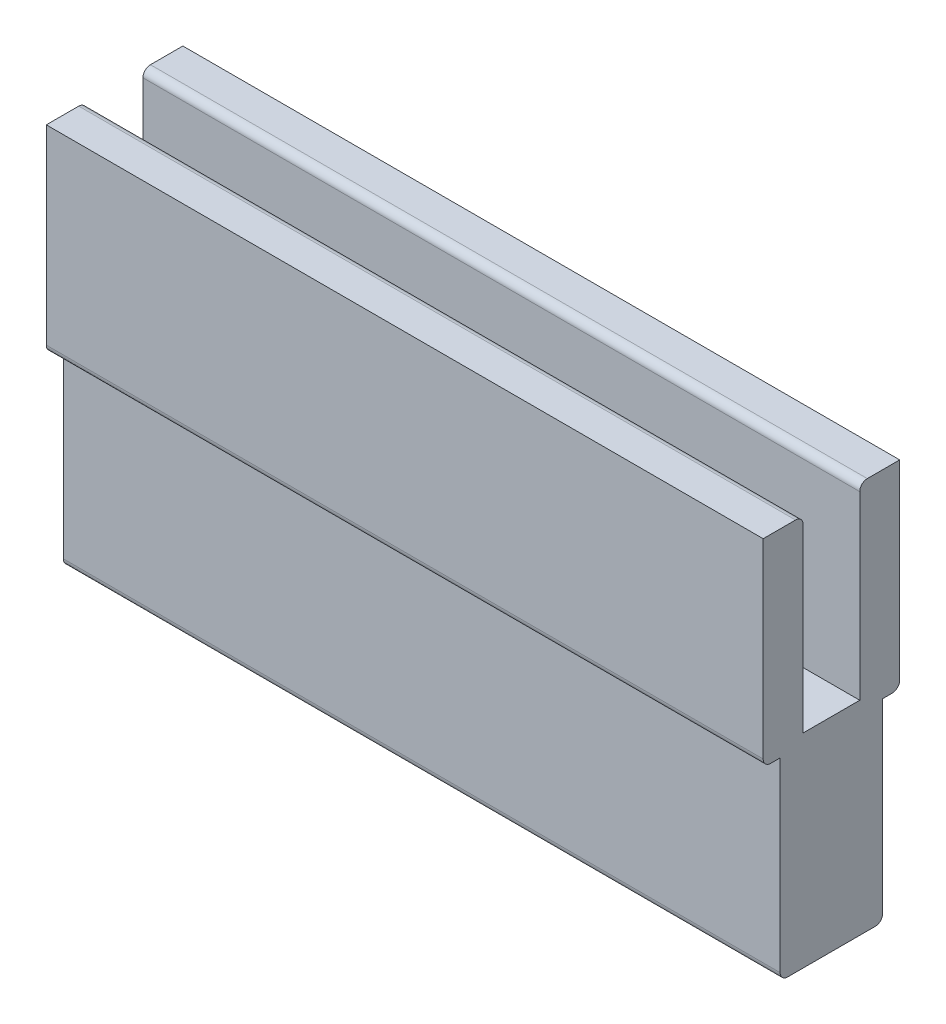
ISO-10303-21;
HEADER;
FILE_DESCRIPTION(('STEP AP214'),'2;1');
FILE_NAME('part.step','',(''),(''),'','','');
FILE_SCHEMA(('AUTOMOTIVE_DESIGN { 1 0 10303 214 1 1 1 1 }'));
ENDSEC;
DATA;
#1=APPLICATION_CONTEXT('core data for automotive mechanical design processes');
#2=APPLICATION_PROTOCOL_DEFINITION('international standard','automotive_design',2000,#1);
#3=PRODUCT_CONTEXT('',#1,'mechanical');
#4=PRODUCT('Part','Part','',(#3));
#5=PRODUCT_RELATED_PRODUCT_CATEGORY('part','',(#4));
#6=PRODUCT_DEFINITION_FORMATION('','',#4);
#7=PRODUCT_DEFINITION_CONTEXT('part definition',#1,'design');
#8=PRODUCT_DEFINITION('design','',#6,#7);
#9=PRODUCT_DEFINITION_SHAPE('','',#8);
#10=(LENGTH_UNIT() NAMED_UNIT(*) SI_UNIT(.MILLI.,.METRE.));
#11=(NAMED_UNIT(*) PLANE_ANGLE_UNIT() SI_UNIT($,.RADIAN.));
#12=(NAMED_UNIT(*) SI_UNIT($,.STERADIAN.) SOLID_ANGLE_UNIT());
#13=UNCERTAINTY_MEASURE_WITH_UNIT(LENGTH_MEASURE(1.E-05),#10,'distance_accuracy_value','');
#14=(GEOMETRIC_REPRESENTATION_CONTEXT(3) GLOBAL_UNCERTAINTY_ASSIGNED_CONTEXT((#13)) GLOBAL_UNIT_ASSIGNED_CONTEXT((#10,
#11,#12)) REPRESENTATION_CONTEXT('',''));
#15=CARTESIAN_POINT('',(0.,0.,0.));
#16=DIRECTION('',(0.,0.,1.));
#17=DIRECTION('',(1.,0.,0.));
#18=AXIS2_PLACEMENT_3D('',#15,#16,#17);
#19=CARTESIAN_POINT('',(-134.704627716474,3.36866350955843E-10,4.77519999809909));
#20=DIRECTION('',(0.,0.,1.));
#21=DIRECTION('',(0.,-1.,0.));
#22=AXIS2_PLACEMENT_3D('',#19,#20,#21);
#23=PLANE('',#22);
#24=DIRECTION('',(0.,-1.,0.));
#25=VECTOR('',#24,1.);
#26=CARTESIAN_POINT('',(-61.595,3.36868905649514E-10,4.77519999809909));
#27=LINE('',#26,#25);
#28=CARTESIAN_POINT('',(-61.595,-1.26999999987985,4.77519999809909));
#29=VERTEX_POINT('',#28);
#30=CARTESIAN_POINT('',(-61.595,-31.7245999996631,4.7751999980991));
#31=VERTEX_POINT('',#30);
#32=EDGE_CURVE('E160',#29,#31,#27,.T.);
#33=ORIENTED_EDGE('',*,*,#32,.F.);
#34=DIRECTION('',(1.,0.,0.));
#35=VECTOR('',#34,1.);
#36=CARTESIAN_POINT('',(-134.704627716474,-1.26999999987985,4.77519999809909));
#37=LINE('',#36,#35);
#38=CARTESIAN_POINT('',(59.2328,-1.26999999987984,4.77519999809909));
#39=VERTEX_POINT('',#38);
#40=EDGE_CURVE('E166',#29,#39,#37,.T.);
#41=ORIENTED_EDGE('',*,*,#40,.T.);
#42=DIRECTION('',(0.,-1.,0.));
#43=VECTOR('',#42,1.);
#44=CARTESIAN_POINT('',(59.2328,3.36873127774912E-10,4.77519999809909));
#45=LINE('',#44,#43);
#46=CARTESIAN_POINT('',(59.2328,-31.7245999996631,4.7751999980991));
#47=VERTEX_POINT('',#46);
#48=EDGE_CURVE('E174',#39,#47,#45,.T.);
#49=ORIENTED_EDGE('',*,*,#48,.T.);
#50=DIRECTION('',(1.,0.,0.));
#51=VECTOR('',#50,1.);
#52=CARTESIAN_POINT('',(-134.704627716474,-31.7245999996631,4.7751999980991));
#53=LINE('',#52,#51);
#54=EDGE_CURVE('E210',#31,#47,#53,.T.);
#55=ORIENTED_EDGE('',*,*,#54,.F.);
#56=EDGE_LOOP('',(#33,#41,#49,#55));
#57=FACE_BOUND('',#56,.T.);
#58=ADVANCED_FACE('F18',(#57),#23,.F.);
#59=CARTESIAN_POINT('',(-134.704627716474,-31.7245999996631,4.7751999980991));
#60=DIRECTION('',(0.,-1.,0.));
#61=DIRECTION('',(1.,0.,0.));
#62=AXIS2_PLACEMENT_3D('',#59,#60,#61);
#63=PLANE('',#62);
#64=DIRECTION('',(0.,0.,-1.));
#65=VECTOR('',#64,1.);
#66=CARTESIAN_POINT('',(-61.595,-31.7245999996631,4.7751999980991));
#67=LINE('',#66,#65);
#68=CARTESIAN_POINT('',(-61.595,-31.7245999996631,-4.77519999809909));
#69=VERTEX_POINT('',#68);
#70=EDGE_CURVE('E206',#31,#69,#67,.T.);
#71=ORIENTED_EDGE('',*,*,#70,.F.);
#72=ORIENTED_EDGE('',*,*,#54,.T.);
#73=DIRECTION('',(0.,0.,-1.));
#74=VECTOR('',#73,1.);
#75=CARTESIAN_POINT('',(59.2328,-31.7245999996631,4.7751999980991));
#76=LINE('',#75,#74);
#77=CARTESIAN_POINT('',(59.2328,-31.7245999996631,-4.77519999809909));
#78=VERTEX_POINT('',#77);
#79=EDGE_CURVE('E213',#47,#78,#76,.T.);
#80=ORIENTED_EDGE('',*,*,#79,.T.);
#81=DIRECTION('',(1.,0.,0.));
#82=VECTOR('',#81,1.);
#83=CARTESIAN_POINT('',(-134.704627716474,-31.7245999996631,-4.77519999809909));
#84=LINE('',#83,#82);
#85=EDGE_CURVE('E214',#69,#78,#84,.T.);
#86=ORIENTED_EDGE('',*,*,#85,.F.);
#87=EDGE_LOOP('',(#71,#72,#80,#86));
#88=FACE_BOUND('',#87,.T.);
#89=ADVANCED_FACE('F280',(#88),#63,.F.);
#90=CARTESIAN_POINT('',(-134.704627716474,3.36865181369163E-10,-4.77519999809909));
#91=DIRECTION('',(0.,0.,-1.));
#92=DIRECTION('',(0.,1.,0.));
#93=AXIS2_PLACEMENT_3D('',#90,#91,#92);
#94=PLANE('',#93);
#95=DIRECTION('',(0.,1.,0.));
#96=VECTOR('',#95,1.);
#97=CARTESIAN_POINT('',(59.2328,3.36871958188234E-10,-4.77519999809909));
#98=LINE('',#97,#96);
#99=CARTESIAN_POINT('',(59.2328,-1.26999999957353,-4.77519999809909));
#100=VERTEX_POINT('',#99);
#101=EDGE_CURVE('E216',#78,#100,#98,.T.);
#102=ORIENTED_EDGE('',*,*,#101,.T.);
#103=DIRECTION('',(1.,0.,0.));
#104=VECTOR('',#103,1.);
#105=CARTESIAN_POINT('',(-134.704627716474,-1.26999999957354,-4.77519999809909));
#106=LINE('',#105,#104);
#107=CARTESIAN_POINT('',(-61.595,-1.26999999957354,-4.77519999809909));
#108=VERTEX_POINT('',#107);
#109=EDGE_CURVE('E11',#100,#108,#106,.F.);
#110=ORIENTED_EDGE('',*,*,#109,.T.);
#111=DIRECTION('',(0.,1.,0.));
#112=VECTOR('',#111,1.);
#113=CARTESIAN_POINT('',(-61.595,3.36867736062836E-10,-4.77519999809909));
#114=LINE('',#113,#112);
#115=EDGE_CURVE('E204',#69,#108,#114,.T.);
#116=ORIENTED_EDGE('',*,*,#115,.F.);
#117=ORIENTED_EDGE('',*,*,#85,.T.);
#118=EDGE_LOOP('',(#102,#110,#116,#117));
#119=FACE_BOUND('',#118,.T.);
#120=ADVANCED_FACE('F282',(#119),#94,.F.);
#121=CARTESIAN_POINT('',(-134.704627716474,3.36865181369163E-10,-4.77519999809909));
#122=DIRECTION('',(0.,-1.,-7.05461458278208E-11));
#123=DIRECTION('',(0.,7.05461458278208E-11,-1.));
#124=AXIS2_PLACEMENT_3D('',#121,#122,#123);
#125=PLANE('',#124);
#126=DIRECTION('',(0.,7.05461458278208E-11,-1.));
#127=VECTOR('',#126,1.);
#128=CARTESIAN_POINT('',(-61.595,3.36867736062836E-10,-4.77519999809909));
#129=LINE('',#128,#127);
#130=CARTESIAN_POINT('',(-61.595,4.26461341257847E-10,-6.0451999980095));
#131=VERTEX_POINT('',#130);
#132=CARTESIAN_POINT('',(-61.595,8.11713843535923E-10,-11.506199996767));
#133=VERTEX_POINT('',#132);
#134=EDGE_CURVE('E202',#131,#133,#129,.T.);
#135=ORIENTED_EDGE('',*,*,#134,.F.);
#136=DIRECTION('',(1.,0.,0.));
#137=VECTOR('',#136,1.);
#138=CARTESIAN_POINT('',(-134.704627716474,4.26458786564175E-10,-6.0451999980095));
#139=LINE('',#138,#137);
#140=CARTESIAN_POINT('',(59.2328,4.26465563383245E-10,-6.0451999980095));
#141=VERTEX_POINT('',#140);
#142=EDGE_CURVE('E26',#131,#141,#139,.T.);
#143=ORIENTED_EDGE('',*,*,#142,.T.);
#144=DIRECTION('',(0.,7.05461458278208E-11,-1.));
#145=VECTOR('',#144,1.);
#146=CARTESIAN_POINT('',(59.2328,3.36871958188234E-10,-4.77519999809909));
#147=LINE('',#146,#145);
#148=CARTESIAN_POINT('',(59.2328,8.11718065661321E-10,-11.506199996767));
#149=VERTEX_POINT('',#148);
#150=EDGE_CURVE('E221',#141,#149,#147,.T.);
#151=ORIENTED_EDGE('',*,*,#150,.T.);
#152=DIRECTION('',(1.,0.,0.));
#153=VECTOR('',#152,1.);
#154=CARTESIAN_POINT('',(-134.704627716474,8.11711288842252E-10,-11.506199996767));
#155=LINE('',#154,#153);
#156=EDGE_CURVE('E217',#133,#149,#155,.T.);
#157=ORIENTED_EDGE('',*,*,#156,.F.);
#158=EDGE_LOOP('',(#135,#143,#151,#157));
#159=FACE_BOUND('',#158,.T.);
#160=ADVANCED_FACE('F261',(#159),#125,.F.);
#161=CARTESIAN_POINT('',(-134.704627716474,8.11711288842252E-10,-11.506199996767));
#162=DIRECTION('',(0.,-1.25964248608914E-10,1.));
#163=DIRECTION('',(0.,-1.,-1.25964248608914E-10));
#164=AXIS2_PLACEMENT_3D('',#161,#162,#163);
#165=PLANE('',#164);
#166=DIRECTION('',(0.,-1.,-1.25964248608914E-10));
#167=VECTOR('',#166,1.);
#168=CARTESIAN_POINT('',(-61.595,8.11713843535923E-10,-11.506199996767));
#169=LINE('',#168,#167);
#170=CARTESIAN_POINT('',(-61.595,-32.1564000073889,-11.5062000008176));
#171=VERTEX_POINT('',#170);
#172=EDGE_CURVE('E199',#133,#171,#169,.T.);
#173=ORIENTED_EDGE('',*,*,#172,.F.);
#174=ORIENTED_EDGE('',*,*,#156,.T.);
#175=DIRECTION('',(0.,-1.,-1.25964248608914E-10));
#176=VECTOR('',#175,1.);
#177=CARTESIAN_POINT('',(59.2328,8.11718065661321E-10,-11.506199996767));
#178=LINE('',#177,#176);
#179=CARTESIAN_POINT('',(59.2328,-32.1564000073889,-11.5062000008176));
#180=VERTEX_POINT('',#179);
#181=EDGE_CURVE('E220',#149,#180,#178,.T.);
#182=ORIENTED_EDGE('',*,*,#181,.T.);
#183=DIRECTION('',(1.,0.,0.));
#184=VECTOR('',#183,1.);
#185=CARTESIAN_POINT('',(-134.704627716474,-32.1564000073889,-11.5062000008176));
#186=LINE('',#185,#184);
#187=EDGE_CURVE('E222',#171,#180,#186,.T.);
#188=ORIENTED_EDGE('',*,*,#187,.F.);
#189=EDGE_LOOP('',(#173,#174,#182,#188));
#190=FACE_BOUND('',#189,.T.);
#191=ADVANCED_FACE('F351',(#190),#165,.F.);
#192=CARTESIAN_POINT('',(-134.704627716474,-32.1564000075489,-10.2362000008176));
#193=DIRECTION('',(1.,0.,0.));
#194=DIRECTION('',(0.,1.,0.));
#195=AXIS2_PLACEMENT_3D('',#192,#193,#194);
#196=CYLINDRICAL_SURFACE('',#195,1.27);
#197=CARTESIAN_POINT('',(-61.595,-32.1564000075489,-10.2362000008176));
#198=DIRECTION('',(-1.,0.,0.));
#199=DIRECTION('',(0.,-1.,0.));
#200=AXIS2_PLACEMENT_3D('',#197,#198,#199);
#201=CIRCLE('',#200,1.27);
#202=CARTESIAN_POINT('',(-61.595,-33.4264000075488,-10.2362000002068));
#203=VERTEX_POINT('',#202);
#204=EDGE_CURVE('E196',#171,#203,#201,.T.);
#205=ORIENTED_EDGE('',*,*,#204,.F.);
#206=ORIENTED_EDGE('',*,*,#187,.T.);
#207=CARTESIAN_POINT('',(59.2328,-32.1564000075489,-10.2362000008176));
#208=DIRECTION('',(-1.,0.,0.));
#209=DIRECTION('',(0.,1.,0.));
#210=AXIS2_PLACEMENT_3D('',#207,#208,#209);
#211=CIRCLE('',#210,1.27);
#212=CARTESIAN_POINT('',(59.2328,-33.4264000075488,-10.2362000002068));
#213=VERTEX_POINT('',#212);
#214=EDGE_CURVE('E224',#180,#213,#211,.T.);
#215=ORIENTED_EDGE('',*,*,#214,.T.);
#216=DIRECTION('',(1.,0.,0.));
#217=VECTOR('',#216,1.);
#218=CARTESIAN_POINT('',(-134.704627716474,-33.4264000075488,-10.2362000002068));
#219=LINE('',#218,#217);
#220=EDGE_CURVE('E225',#203,#213,#219,.T.);
#221=ORIENTED_EDGE('',*,*,#220,.F.);
#222=EDGE_LOOP('',(#205,#206,#215,#221));
#223=FACE_BOUND('',#222,.T.);
#224=ADVANCED_FACE('F347',(#223),#196,.T.);
#225=CARTESIAN_POINT('',(-134.704627716474,-33.4264000067854,-8.64869999904722));
#226=DIRECTION('',(0.,1.,-4.80901407583008E-10));
#227=DIRECTION('',(0.,4.80901407583008E-10,1.));
#228=AXIS2_PLACEMENT_3D('',#225,#226,#227);
#229=PLANE('',#228);
#230=DIRECTION('',(0.,4.80901407583008E-10,1.));
#231=VECTOR('',#230,1.);
#232=CARTESIAN_POINT('',(-61.595,-33.4264000067854,-8.64869999904722));
#233=LINE('',#232,#231);
#234=CARTESIAN_POINT('',(-61.595,-33.4264000067854,-8.64869999904722));
#235=VERTEX_POINT('',#234);
#236=EDGE_CURVE('E193',#203,#235,#233,.T.);
#237=ORIENTED_EDGE('',*,*,#236,.F.);
#238=ORIENTED_EDGE('',*,*,#220,.T.);
#239=DIRECTION('',(0.,4.80901407583008E-10,1.));
#240=VECTOR('',#239,1.);
#241=CARTESIAN_POINT('',(59.2328,-33.4264000067854,-8.64869999904722));
#242=LINE('',#241,#240);
#243=CARTESIAN_POINT('',(59.2328,-33.4264000067854,-8.64869999904722));
#244=VERTEX_POINT('',#243);
#245=EDGE_CURVE('E227',#213,#244,#242,.T.);
#246=ORIENTED_EDGE('',*,*,#245,.T.);
#247=DIRECTION('',(1.,0.,0.));
#248=VECTOR('',#247,1.);
#249=CARTESIAN_POINT('',(-134.704627716474,-33.4264000067854,-8.64869999904722));
#250=LINE('',#249,#248);
#251=EDGE_CURVE('E228',#235,#244,#250,.T.);
#252=ORIENTED_EDGE('',*,*,#251,.F.);
#253=EDGE_LOOP('',(#237,#238,#246,#252));
#254=FACE_BOUND('',#253,.T.);
#255=ADVANCED_FACE('F343',(#254),#229,.F.);
#256=CARTESIAN_POINT('',(-134.704627716474,-33.4264000067854,-8.64869999904722));
#257=DIRECTION('',(0.,-1.28813163686896E-10,1.));
#258=DIRECTION('',(0.,-1.,-1.28813163686896E-10));
#259=AXIS2_PLACEMENT_3D('',#256,#257,#258);
#260=PLANE('',#259);
#261=DIRECTION('',(0.,-1.,-1.28813163686896E-10));
#262=VECTOR('',#261,1.);
#263=CARTESIAN_POINT('',(-61.595,-33.4264000067854,-8.64869999904722));
#264=LINE('',#263,#262);
#265=CARTESIAN_POINT('',(-61.595,-64.7699999993159,-8.64870000308469));
#266=VERTEX_POINT('',#265);
#267=EDGE_CURVE('E190',#235,#266,#264,.T.);
#268=ORIENTED_EDGE('',*,*,#267,.F.);
#269=ORIENTED_EDGE('',*,*,#251,.T.);
#270=DIRECTION('',(0.,-1.,-1.28813163686896E-10));
#271=VECTOR('',#270,1.);
#272=CARTESIAN_POINT('',(59.2328,-33.4264000067854,-8.64869999904722));
#273=LINE('',#272,#271);
#274=CARTESIAN_POINT('',(59.2328,-64.7699999993159,-8.64870000308469));
#275=VERTEX_POINT('',#274);
#276=EDGE_CURVE('E230',#244,#275,#273,.T.);
#277=ORIENTED_EDGE('',*,*,#276,.T.);
#278=DIRECTION('',(1.,0.,0.));
#279=VECTOR('',#278,1.);
#280=CARTESIAN_POINT('',(-134.704627716474,-64.7699999993159,-8.64870000308469));
#281=LINE('',#280,#279);
#282=EDGE_CURVE('E231',#266,#275,#281,.T.);
#283=ORIENTED_EDGE('',*,*,#282,.F.);
#284=EDGE_LOOP('',(#268,#269,#277,#283));
#285=FACE_BOUND('',#284,.T.);
#286=ADVANCED_FACE('F339',(#285),#260,.F.);
#287=CARTESIAN_POINT('',(-134.704627716474,-64.7699999994795,-7.37870000308469));
#288=DIRECTION('',(1.,0.,0.));
#289=DIRECTION('',(0.,1.,0.));
#290=AXIS2_PLACEMENT_3D('',#287,#288,#289);
#291=CYLINDRICAL_SURFACE('',#290,1.27);
#292=CARTESIAN_POINT('',(-61.595,-64.7699999994795,-7.37870000308469));
#293=DIRECTION('',(-1.,0.,0.));
#294=DIRECTION('',(0.,-1.,0.));
#295=AXIS2_PLACEMENT_3D('',#292,#293,#294);
#296=CIRCLE('',#295,1.27);
#297=CARTESIAN_POINT('',(-61.595,-66.0399999994795,-7.37870000317428));
#298=VERTEX_POINT('',#297);
#299=EDGE_CURVE('E187',#266,#298,#296,.T.);
#300=ORIENTED_EDGE('',*,*,#299,.F.);
#301=ORIENTED_EDGE('',*,*,#282,.T.);
#302=CARTESIAN_POINT('',(59.2328,-64.7699999994795,-7.37870000308469));
#303=DIRECTION('',(-1.,0.,0.));
#304=DIRECTION('',(0.,-1.,0.));
#305=AXIS2_PLACEMENT_3D('',#302,#303,#304);
#306=CIRCLE('',#305,1.27);
#307=CARTESIAN_POINT('',(59.2328,-66.0399999994795,-7.37870000317428));
#308=VERTEX_POINT('',#307);
#309=EDGE_CURVE('E233',#275,#308,#306,.T.);
#310=ORIENTED_EDGE('',*,*,#309,.T.);
#311=DIRECTION('',(1.,0.,0.));
#312=VECTOR('',#311,1.);
#313=CARTESIAN_POINT('',(-134.704627716474,-66.0399999994795,-7.37870000317428));
#314=LINE('',#313,#312);
#315=EDGE_CURVE('E234',#298,#308,#314,.T.);
#316=ORIENTED_EDGE('',*,*,#315,.F.);
#317=EDGE_LOOP('',(#300,#301,#310,#316));
#318=FACE_BOUND('',#317,.T.);
#319=ADVANCED_FACE('F335',(#318),#291,.T.);
#320=CARTESIAN_POINT('',(-134.704627716474,-66.0399999994795,-7.37870000317428));
#321=DIRECTION('',(0.,1.,7.0543744318534E-11));
#322=DIRECTION('',(0.,-7.0543744318534E-11,1.));
#323=AXIS2_PLACEMENT_3D('',#320,#321,#322);
#324=PLANE('',#323);
#325=DIRECTION('',(0.,-7.0543744318534E-11,1.));
#326=VECTOR('',#325,1.);
#327=CARTESIAN_POINT('',(-61.595,-66.0399999994795,-7.37870000317428));
#328=LINE('',#327,#326);
#329=CARTESIAN_POINT('',(-61.595,-66.0400000005205,7.37869999678133));
#330=VERTEX_POINT('',#329);
#331=EDGE_CURVE('E184',#298,#330,#328,.T.);
#332=ORIENTED_EDGE('',*,*,#331,.F.);
#333=ORIENTED_EDGE('',*,*,#315,.T.);
#334=DIRECTION('',(0.,-7.0543744318534E-11,1.));
#335=VECTOR('',#334,1.);
#336=CARTESIAN_POINT('',(59.2328,-66.0399999994795,-7.37870000317428));
#337=LINE('',#336,#335);
#338=CARTESIAN_POINT('',(59.2328,-66.0400000005205,7.37869999678133));
#339=VERTEX_POINT('',#338);
#340=EDGE_CURVE('E236',#308,#339,#337,.T.);
#341=ORIENTED_EDGE('',*,*,#340,.T.);
#342=DIRECTION('',(1.,0.,0.));
#343=VECTOR('',#342,1.);
#344=CARTESIAN_POINT('',(-134.704627716474,-66.0400000005205,7.37869999678133));
#345=LINE('',#344,#343);
#346=EDGE_CURVE('E237',#330,#339,#345,.T.);
#347=ORIENTED_EDGE('',*,*,#346,.F.);
#348=EDGE_LOOP('',(#332,#333,#341,#347));
#349=FACE_BOUND('',#348,.T.);
#350=ADVANCED_FACE('F331',(#349),#324,.F.);
#351=CARTESIAN_POINT('',(-134.704627716474,-64.7700000005205,7.37869999687092));
#352=DIRECTION('',(1.,0.,0.));
#353=DIRECTION('',(0.,1.,0.));
#354=AXIS2_PLACEMENT_3D('',#351,#352,#353);
#355=CYLINDRICAL_SURFACE('',#354,1.27);
#356=CARTESIAN_POINT('',(-61.595,-64.7700000005205,7.37869999687092));
#357=DIRECTION('',(-1.,0.,0.));
#358=DIRECTION('',(0.,-1.,0.));
#359=AXIS2_PLACEMENT_3D('',#356,#357,#358);
#360=CIRCLE('',#359,1.27);
#361=CARTESIAN_POINT('',(-61.595,-64.7700000005731,8.64869999687092));
#362=VERTEX_POINT('',#361);
#363=EDGE_CURVE('E181',#330,#362,#360,.T.);
#364=ORIENTED_EDGE('',*,*,#363,.F.);
#365=ORIENTED_EDGE('',*,*,#346,.T.);
#366=CARTESIAN_POINT('',(59.2328,-64.7700000005205,7.37869999687092));
#367=DIRECTION('',(-1.,0.,0.));
#368=DIRECTION('',(0.,-1.,0.));
#369=AXIS2_PLACEMENT_3D('',#366,#367,#368);
#370=CIRCLE('',#369,1.27);
#371=CARTESIAN_POINT('',(59.2328,-64.7700000005731,8.64869999687092));
#372=VERTEX_POINT('',#371);
#373=EDGE_CURVE('E239',#339,#372,#370,.T.);
#374=ORIENTED_EDGE('',*,*,#373,.T.);
#375=DIRECTION('',(1.,0.,0.));
#376=VECTOR('',#375,1.);
#377=CARTESIAN_POINT('',(-134.704627716474,-64.7700000005731,8.64869999687092));
#378=LINE('',#377,#376);
#379=EDGE_CURVE('E240',#362,#372,#378,.T.);
#380=ORIENTED_EDGE('',*,*,#379,.F.);
#381=EDGE_LOOP('',(#364,#365,#374,#380));
#382=FACE_BOUND('',#381,.T.);
#383=ADVANCED_FACE('F327',(#382),#355,.T.);
#384=CARTESIAN_POINT('',(-134.704627716474,-33.4263999984671,8.64869999816894));
#385=DIRECTION('',(0.,4.14126792494708E-11,-1.));
#386=DIRECTION('',(0.,1.,4.14126792494708E-11));
#387=AXIS2_PLACEMENT_3D('',#384,#385,#386);
#388=PLANE('',#387);
#389=DIRECTION('',(0.,1.,4.14126792494708E-11));
#390=VECTOR('',#389,1.);
#391=CARTESIAN_POINT('',(-61.595,-33.4263999984671,8.64869999816894));
#392=LINE('',#391,#390);
#393=CARTESIAN_POINT('',(-61.595,-33.4263999984671,8.64869999816894));
#394=VERTEX_POINT('',#393);
#395=EDGE_CURVE('E178',#362,#394,#392,.T.);
#396=ORIENTED_EDGE('',*,*,#395,.F.);
#397=ORIENTED_EDGE('',*,*,#379,.T.);
#398=DIRECTION('',(0.,1.,4.14126792494708E-11));
#399=VECTOR('',#398,1.);
#400=CARTESIAN_POINT('',(59.2328,-33.4263999984671,8.64869999816894));
#401=LINE('',#400,#399);
#402=CARTESIAN_POINT('',(59.2328,-33.4263999984671,8.64869999816894));
#403=VERTEX_POINT('',#402);
#404=EDGE_CURVE('E242',#372,#403,#401,.T.);
#405=ORIENTED_EDGE('',*,*,#404,.T.);
#406=DIRECTION('',(1.,0.,0.));
#407=VECTOR('',#406,1.);
#408=CARTESIAN_POINT('',(-134.704627716474,-33.4263999984671,8.64869999816894));
#409=LINE('',#408,#407);
#410=EDGE_CURVE('E243',#394,#403,#409,.T.);
#411=ORIENTED_EDGE('',*,*,#410,.F.);
#412=EDGE_LOOP('',(#396,#397,#405,#411));
#413=FACE_BOUND('',#412,.T.);
#414=ADVANCED_FACE('F323',(#413),#388,.F.);
#415=CARTESIAN_POINT('',(-134.704627716474,-33.4263999977037,10.236199203684));
#416=DIRECTION('',(0.,1.,-4.80901648607743E-10));
#417=DIRECTION('',(0.,4.80901648607743E-10,1.));
#418=AXIS2_PLACEMENT_3D('',#415,#416,#417);
#419=PLANE('',#418);
#420=DIRECTION('',(0.,4.80901648607743E-10,1.));
#421=VECTOR('',#420,1.);
#422=CARTESIAN_POINT('',(-61.595,-33.4263999977037,10.236199203684));
#423=LINE('',#422,#421);
#424=CARTESIAN_POINT('',(-61.595,-33.4263999977037,10.236199203684));
#425=VERTEX_POINT('',#424);
#426=EDGE_CURVE('E171',#394,#425,#423,.T.);
#427=ORIENTED_EDGE('',*,*,#426,.F.);
#428=ORIENTED_EDGE('',*,*,#410,.T.);
#429=DIRECTION('',(0.,4.80901648607743E-10,1.));
#430=VECTOR('',#429,1.);
#431=CARTESIAN_POINT('',(59.2328,-33.4263999977037,10.236199203684));
#432=LINE('',#431,#430);
#433=CARTESIAN_POINT('',(59.2328,-33.4263999977037,10.236199203684));
#434=VERTEX_POINT('',#433);
#435=EDGE_CURVE('E245',#403,#434,#432,.T.);
#436=ORIENTED_EDGE('',*,*,#435,.T.);
#437=DIRECTION('',(1.,0.,0.));
#438=VECTOR('',#437,1.);
#439=CARTESIAN_POINT('',(-134.704627716474,-33.4263999977037,10.236199203684));
#440=LINE('',#439,#438);
#441=EDGE_CURVE('E246',#425,#434,#440,.T.);
#442=ORIENTED_EDGE('',*,*,#441,.F.);
#443=EDGE_LOOP('',(#427,#428,#436,#442));
#444=FACE_BOUND('',#443,.T.);
#445=ADVANCED_FACE('F319',(#444),#419,.F.);
#446=CARTESIAN_POINT('',(-134.704627716474,-32.1563999977037,10.2361992030733));
#447=DIRECTION('',(1.,0.,0.));
#448=DIRECTION('',(0.,1.,0.));
#449=AXIS2_PLACEMENT_3D('',#446,#447,#448);
#450=CYLINDRICAL_SURFACE('',#449,1.27);
#451=CARTESIAN_POINT('',(-61.595,-32.1563999977037,10.2361992030733));
#452=DIRECTION('',(-1.,0.,0.));
#453=DIRECTION('',(0.,-1.,0.));
#454=AXIS2_PLACEMENT_3D('',#451,#452,#453);
#455=CIRCLE('',#454,1.27);
#456=CARTESIAN_POINT('',(-61.595,-32.1564000290648,11.5061992030733));
#457=VERTEX_POINT('',#456);
#458=EDGE_CURVE('E165',#425,#457,#455,.T.);
#459=ORIENTED_EDGE('',*,*,#458,.F.);
#460=ORIENTED_EDGE('',*,*,#441,.T.);
#461=CARTESIAN_POINT('',(59.2328,-32.1563999977037,10.2361992030733));
#462=DIRECTION('',(-1.,0.,0.));
#463=DIRECTION('',(0.,-1.,0.));
#464=AXIS2_PLACEMENT_3D('',#461,#462,#463);
#465=CIRCLE('',#464,1.27);
#466=CARTESIAN_POINT('',(59.2328,-32.1564000290648,11.5061992030733));
#467=VERTEX_POINT('',#466);
#468=EDGE_CURVE('E248',#434,#467,#465,.T.);
#469=ORIENTED_EDGE('',*,*,#468,.T.);
#470=DIRECTION('',(1.,0.,0.));
#471=VECTOR('',#470,1.);
#472=CARTESIAN_POINT('',(-134.704627716474,-32.1564000290648,11.5061992030733));
#473=LINE('',#472,#471);
#474=EDGE_CURVE('E249',#457,#467,#473,.T.);
#475=ORIENTED_EDGE('',*,*,#474,.F.);
#476=EDGE_LOOP('',(#459,#460,#469,#475));
#477=FACE_BOUND('',#476,.T.);
#478=ADVANCED_FACE('F316',(#477),#450,.T.);
#479=CARTESIAN_POINT('',(-134.704627716474,-32.1564000290648,11.5061992030733));
#480=DIRECTION('',(0.,2.46938004191586E-08,-1.));
#481=DIRECTION('',(0.,1.,2.46938004191586E-08));
#482=AXIS2_PLACEMENT_3D('',#479,#480,#481);
#483=PLANE('',#482);
#484=DIRECTION('',(0.,1.,2.46938004191586E-08));
#485=VECTOR('',#484,1.);
#486=CARTESIAN_POINT('',(-61.595,-32.1564000290648,11.5061992030733));
#487=LINE('',#486,#485);
#488=CARTESIAN_POINT('',(-61.595,-8.11722282282169E-10,11.506199997137));
#489=VERTEX_POINT('',#488);
#490=EDGE_CURVE('E145',#457,#489,#487,.T.);
#491=ORIENTED_EDGE('',*,*,#490,.F.);
#492=ORIENTED_EDGE('',*,*,#474,.T.);
#493=DIRECTION('',(0.,1.,2.46938004191586E-08));
#494=VECTOR('',#493,1.);
#495=CARTESIAN_POINT('',(59.2328,-32.1564000290648,11.5061992030733));
#496=LINE('',#495,#494);
#497=CARTESIAN_POINT('',(59.2328,-8.11718060156771E-10,11.506199997137));
#498=VERTEX_POINT('',#497);
#499=EDGE_CURVE('E148',#467,#498,#496,.T.);
#500=ORIENTED_EDGE('',*,*,#499,.T.);
#501=DIRECTION('',(1.,0.,0.));
#502=VECTOR('',#501,1.);
#503=CARTESIAN_POINT('',(-134.704627716474,-8.11724836975841E-10,11.506199997137));
#504=LINE('',#503,#502);
#505=EDGE_CURVE('E141',#489,#498,#504,.T.);
#506=ORIENTED_EDGE('',*,*,#505,.F.);
#507=EDGE_LOOP('',(#491,#492,#500,#506));
#508=FACE_BOUND('',#507,.T.);
#509=ADVANCED_FACE('F143',(#508),#483,.F.);
#510=CARTESIAN_POINT('',(-134.704627716474,-8.11724836975841E-10,11.506199997137));
#511=DIRECTION('',(0.,-1.,-1.70641983077679E-10));
#512=DIRECTION('',(0.,1.70641983077679E-10,-1.));
#513=AXIS2_PLACEMENT_3D('',#510,#511,#512);
#514=PLANE('',#513);
#515=DIRECTION('',(0.,1.70641983077679E-10,-1.));
#516=VECTOR('',#515,1.);
#517=CARTESIAN_POINT('',(59.2328,-8.11718060156771E-10,11.506199997137));
#518=LINE('',#517,#516);
#519=CARTESIAN_POINT('',(59.2328,1.20157809229279E-10,6.04519999831581));
#520=VERTEX_POINT('',#519);
#521=EDGE_CURVE('E152',#498,#520,#518,.T.);
#522=ORIENTED_EDGE('',*,*,#521,.T.);
#523=DIRECTION('',(1.,0.,0.));
#524=VECTOR('',#523,1.);
#525=CARTESIAN_POINT('',(-134.704627716474,1.20151032410209E-10,6.04519999831581));
#526=LINE('',#525,#524);
#527=CARTESIAN_POINT('',(-61.595,1.20153587103881E-10,6.04519999831581));
#528=VERTEX_POINT('',#527);
#529=EDGE_CURVE('E158',#520,#528,#526,.F.);
#530=ORIENTED_EDGE('',*,*,#529,.T.);
#531=DIRECTION('',(0.,1.70641983077679E-10,-1.));
#532=VECTOR('',#531,1.);
#533=CARTESIAN_POINT('',(-61.595,-8.11722282282169E-10,11.506199997137));
#534=LINE('',#533,#532);
#535=EDGE_CURVE('E155',#489,#528,#534,.T.);
#536=ORIENTED_EDGE('',*,*,#535,.F.);
#537=ORIENTED_EDGE('',*,*,#505,.T.);
#538=EDGE_LOOP('',(#522,#530,#536,#537));
#539=FACE_BOUND('',#538,.T.);
#540=ADVANCED_FACE('F156',(#539),#514,.F.);
#541=CARTESIAN_POINT('',(59.2328,-32.1564000075489,-10.2362000008176));
#542=DIRECTION('',(1.,0.,0.));
#543=DIRECTION('',(0.,1.,0.));
#544=AXIS2_PLACEMENT_3D('',#541,#542,#543);
#545=PLANE('',#544);
#546=ORIENTED_EDGE('',*,*,#48,.F.);
#547=CARTESIAN_POINT('',(59.2328,-1.26999999987984,6.04519999809909));
#548=DIRECTION('',(1.,0.,0.));
#549=DIRECTION('',(0.,1.,0.));
#550=AXIS2_PLACEMENT_3D('',#547,#548,#549);
#551=CIRCLE('',#550,1.27);
#552=EDGE_CURVE('E252',#39,#520,#551,.T.);
#553=ORIENTED_EDGE('',*,*,#552,.T.);
#554=ORIENTED_EDGE('',*,*,#521,.F.);
#555=ORIENTED_EDGE('',*,*,#499,.F.);
#556=ORIENTED_EDGE('',*,*,#468,.F.);
#557=ORIENTED_EDGE('',*,*,#435,.F.);
#558=ORIENTED_EDGE('',*,*,#404,.F.);
#559=ORIENTED_EDGE('',*,*,#373,.F.);
#560=ORIENTED_EDGE('',*,*,#340,.F.);
#561=ORIENTED_EDGE('',*,*,#309,.F.);
#562=ORIENTED_EDGE('',*,*,#276,.F.);
#563=ORIENTED_EDGE('',*,*,#245,.F.);
#564=ORIENTED_EDGE('',*,*,#214,.F.);
#565=ORIENTED_EDGE('',*,*,#181,.F.);
#566=ORIENTED_EDGE('',*,*,#150,.F.);
#567=CARTESIAN_POINT('',(59.2328,-1.26999999957353,-6.04519999809909));
#568=DIRECTION('',(1.,0.,0.));
#569=DIRECTION('',(0.,1.,0.));
#570=AXIS2_PLACEMENT_3D('',#567,#568,#569);
#571=CIRCLE('',#570,1.27);
#572=EDGE_CURVE('E169',#141,#100,#571,.T.);
#573=ORIENTED_EDGE('',*,*,#572,.T.);
#574=ORIENTED_EDGE('',*,*,#101,.F.);
#575=ORIENTED_EDGE('',*,*,#79,.F.);
#576=EDGE_LOOP('',(#546,#553,#554,#555,#556,#557,#558,#559,#560,#561,#562,#563,#564,#565,#566,
#573,#574,#575));
#577=FACE_BOUND('',#576,.T.);
#578=ADVANCED_FACE('F267',(#577),#545,.T.);
#579=CARTESIAN_POINT('',(-61.595,32.7660000012621,-17.8905407962335));
#580=DIRECTION('',(-1.,0.,0.));
#581=DIRECTION('',(0.,-1.,-7.05461458278207E-11));
#582=AXIS2_PLACEMENT_3D('',#579,#580,#581);
#583=PLANE('',#582);
#584=ORIENTED_EDGE('',*,*,#535,.T.);
#585=CARTESIAN_POINT('',(-61.595,-1.26999999987985,6.04519999809909));
#586=DIRECTION('',(-1.,0.,0.));
#587=DIRECTION('',(0.,-1.,0.));
#588=AXIS2_PLACEMENT_3D('',#585,#586,#587);
#589=CIRCLE('',#588,1.27);
#590=EDGE_CURVE('E256',#528,#29,#589,.T.);
#591=ORIENTED_EDGE('',*,*,#590,.T.);
#592=ORIENTED_EDGE('',*,*,#32,.T.);
#593=ORIENTED_EDGE('',*,*,#70,.T.);
#594=ORIENTED_EDGE('',*,*,#115,.T.);
#595=CARTESIAN_POINT('',(-61.595,-1.26999999957354,-6.04519999809909));
#596=DIRECTION('',(-1.,0.,0.));
#597=DIRECTION('',(0.,-1.,0.));
#598=AXIS2_PLACEMENT_3D('',#595,#596,#597);
#599=CIRCLE('',#598,1.27);
#600=EDGE_CURVE('E33',#108,#131,#599,.T.);
#601=ORIENTED_EDGE('',*,*,#600,.T.);
#602=ORIENTED_EDGE('',*,*,#134,.T.);
#603=ORIENTED_EDGE('',*,*,#172,.T.);
#604=ORIENTED_EDGE('',*,*,#204,.T.);
#605=ORIENTED_EDGE('',*,*,#236,.T.);
#606=ORIENTED_EDGE('',*,*,#267,.T.);
#607=ORIENTED_EDGE('',*,*,#299,.T.);
#608=ORIENTED_EDGE('',*,*,#331,.T.);
#609=ORIENTED_EDGE('',*,*,#363,.T.);
#610=ORIENTED_EDGE('',*,*,#395,.T.);
#611=ORIENTED_EDGE('',*,*,#426,.T.);
#612=ORIENTED_EDGE('',*,*,#458,.T.);
#613=ORIENTED_EDGE('',*,*,#490,.T.);
#614=EDGE_LOOP('',(#584,#591,#592,#593,#594,#601,#602,#603,#604,#605,#606,#607,#608,#609,#610,
#611,#612,#613));
#615=FACE_BOUND('',#614,.T.);
#616=ADVANCED_FACE('F163',(#615),#583,.T.);
#617=CARTESIAN_POINT('',(-134.704627716474,-1.26999999987985,6.04519999809909));
#618=DIRECTION('',(1.,0.,0.));
#619=DIRECTION('',(0.,1.,0.));
#620=AXIS2_PLACEMENT_3D('',#617,#618,#619);
#621=CYLINDRICAL_SURFACE('',#620,1.27);
#622=ORIENTED_EDGE('',*,*,#590,.F.);
#623=ORIENTED_EDGE('',*,*,#529,.F.);
#624=ORIENTED_EDGE('',*,*,#552,.F.);
#625=ORIENTED_EDGE('',*,*,#40,.F.);
#626=EDGE_LOOP('',(#622,#623,#624,#625));
#627=FACE_BOUND('',#626,.T.);
#628=ADVANCED_FACE('F284',(#627),#621,.T.);
#629=CARTESIAN_POINT('',(-134.704627716474,-1.26999999957354,-6.04519999809909));
#630=DIRECTION('',(1.,0.,0.));
#631=DIRECTION('',(0.,1.,0.));
#632=AXIS2_PLACEMENT_3D('',#629,#630,#631);
#633=CYLINDRICAL_SURFACE('',#632,1.27);
#634=ORIENTED_EDGE('',*,*,#600,.F.);
#635=ORIENTED_EDGE('',*,*,#109,.F.);
#636=ORIENTED_EDGE('',*,*,#572,.F.);
#637=ORIENTED_EDGE('',*,*,#142,.F.);
#638=EDGE_LOOP('',(#634,#635,#636,#637));
#639=FACE_BOUND('',#638,.T.);
#640=ADVANCED_FACE('F20',(#639),#633,.T.);
#641=CLOSED_SHELL('',(#58,#89,#120,#160,#191,#224,#255,#286,#319,#350,#383,#414,#445,#478,#509,
#540,#578,#616,#628,#640));
#642=MANIFOLD_SOLID_BREP('B1',#641);
#643=ADVANCED_BREP_SHAPE_REPRESENTATION('',(#18,#642),#14);
#644=SHAPE_DEFINITION_REPRESENTATION(#9,#643);
ENDSEC;
END-ISO-10303-21;
